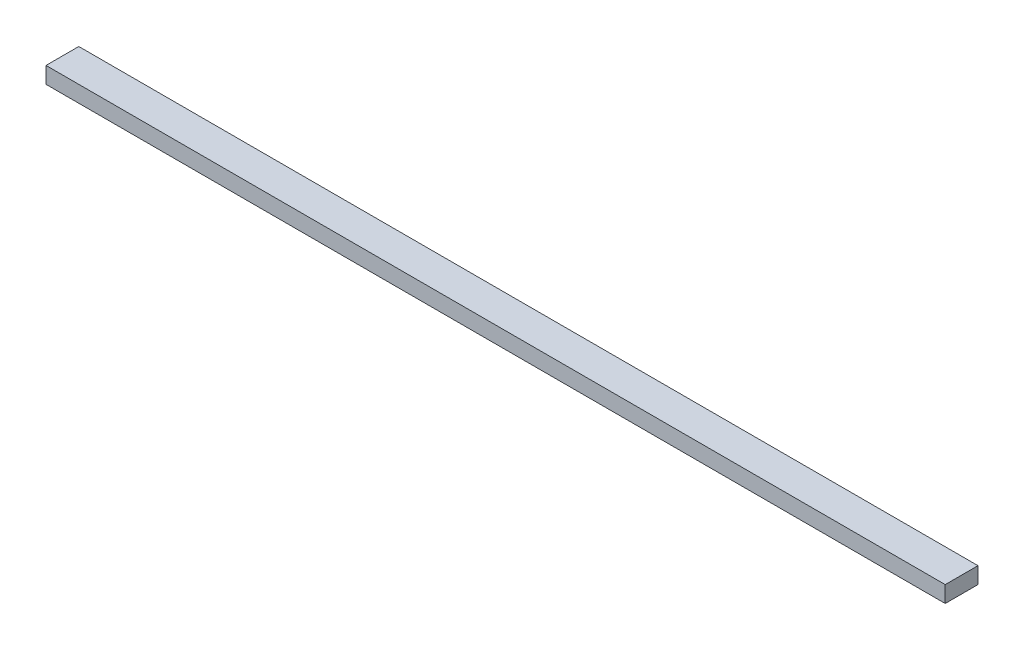
ISO-10303-21;
HEADER;
FILE_DESCRIPTION(('STEP AP214'),'2;1');
FILE_NAME('part.step','',(''),(''),'','','');
FILE_SCHEMA(('AUTOMOTIVE_DESIGN { 1 0 10303 214 1 1 1 1 }'));
ENDSEC;
DATA;
#1=APPLICATION_CONTEXT('core data for automotive mechanical design processes');
#2=APPLICATION_PROTOCOL_DEFINITION('international standard','automotive_design',2000,#1);
#3=PRODUCT_CONTEXT('',#1,'mechanical');
#4=PRODUCT('Part','Part','',(#3));
#5=PRODUCT_RELATED_PRODUCT_CATEGORY('part','',(#4));
#6=PRODUCT_DEFINITION_FORMATION('','',#4);
#7=PRODUCT_DEFINITION_CONTEXT('part definition',#1,'design');
#8=PRODUCT_DEFINITION('design','',#6,#7);
#9=PRODUCT_DEFINITION_SHAPE('','',#8);
#10=(LENGTH_UNIT() NAMED_UNIT(*) SI_UNIT(.MILLI.,.METRE.));
#11=(NAMED_UNIT(*) PLANE_ANGLE_UNIT() SI_UNIT($,.RADIAN.));
#12=(NAMED_UNIT(*) SI_UNIT($,.STERADIAN.) SOLID_ANGLE_UNIT());
#13=UNCERTAINTY_MEASURE_WITH_UNIT(LENGTH_MEASURE(1.E-05),#10,'distance_accuracy_value','');
#14=(GEOMETRIC_REPRESENTATION_CONTEXT(3) GLOBAL_UNCERTAINTY_ASSIGNED_CONTEXT((#13)) GLOBAL_UNIT_ASSIGNED_CONTEXT((#10,
#11,#12)) REPRESENTATION_CONTEXT('',''));
#15=CARTESIAN_POINT('',(0.,0.,0.));
#16=DIRECTION('',(0.,0.,1.));
#17=DIRECTION('',(1.,0.,0.));
#18=AXIS2_PLACEMENT_3D('',#15,#16,#17);
#19=CARTESIAN_POINT('',(-274.265,10.,-9.99999999999998));
#20=DIRECTION('',(1.,0.,0.));
#21=DIRECTION('',(0.,0.,-1.));
#22=AXIS2_PLACEMENT_3D('',#19,#20,#21);
#23=PLANE('',#22);
#24=DIRECTION('',(0.,0.,1.));
#25=VECTOR('',#24,1.);
#26=CARTESIAN_POINT('',(-274.265,0.,-9.99999999999998));
#27=LINE('',#26,#25);
#28=CARTESIAN_POINT('',(-274.265,0.,-9.99999999999998));
#29=VERTEX_POINT('',#28);
#30=CARTESIAN_POINT('',(-274.265,0.,10.));
#31=VERTEX_POINT('',#30);
#32=EDGE_CURVE('E95',#29,#31,#27,.T.);
#33=ORIENTED_EDGE('',*,*,#32,.T.);
#34=DIRECTION('',(0.,-1.,0.));
#35=VECTOR('',#34,1.);
#36=CARTESIAN_POINT('',(-274.265,10.,10.));
#37=LINE('',#36,#35);
#38=CARTESIAN_POINT('',(-274.265,10.,10.));
#39=VERTEX_POINT('',#38);
#40=EDGE_CURVE('E11',#39,#31,#37,.T.);
#41=ORIENTED_EDGE('',*,*,#40,.F.);
#42=DIRECTION('',(0.,0.,1.));
#43=VECTOR('',#42,1.);
#44=CARTESIAN_POINT('',(-274.265,10.,-9.99999999999998));
#45=LINE('',#44,#43);
#46=CARTESIAN_POINT('',(-274.265,10.,-9.99999999999998));
#47=VERTEX_POINT('',#46);
#48=EDGE_CURVE('E83',#47,#39,#45,.T.);
#49=ORIENTED_EDGE('',*,*,#48,.F.);
#50=DIRECTION('',(0.,-1.,0.));
#51=VECTOR('',#50,1.);
#52=CARTESIAN_POINT('',(-274.265,10.,-9.99999999999998));
#53=LINE('',#52,#51);
#54=EDGE_CURVE('E91',#47,#29,#53,.T.);
#55=ORIENTED_EDGE('',*,*,#54,.T.);
#56=EDGE_LOOP('',(#33,#41,#49,#55));
#57=FACE_BOUND('',#56,.T.);
#58=ADVANCED_FACE('F32',(#57),#23,.F.);
#59=CARTESIAN_POINT('',(-274.265,10.,10.));
#60=DIRECTION('',(0.,0.,-1.));
#61=DIRECTION('',(-1.,0.,0.));
#62=AXIS2_PLACEMENT_3D('',#59,#60,#61);
#63=PLANE('',#62);
#64=DIRECTION('',(1.,0.,0.));
#65=VECTOR('',#64,1.);
#66=CARTESIAN_POINT('',(-274.265,0.,10.));
#67=LINE('',#66,#65);
#68=CARTESIAN_POINT('',(274.265,0.,10.));
#69=VERTEX_POINT('',#68);
#70=EDGE_CURVE('E87',#31,#69,#67,.T.);
#71=ORIENTED_EDGE('',*,*,#70,.T.);
#72=DIRECTION('',(0.,-1.,0.));
#73=VECTOR('',#72,1.);
#74=CARTESIAN_POINT('',(274.265,10.,10.));
#75=LINE('',#74,#73);
#76=CARTESIAN_POINT('',(274.265,10.,10.));
#77=VERTEX_POINT('',#76);
#78=EDGE_CURVE('E40',#77,#69,#75,.T.);
#79=ORIENTED_EDGE('',*,*,#78,.F.);
#80=DIRECTION('',(1.,0.,0.));
#81=VECTOR('',#80,1.);
#82=CARTESIAN_POINT('',(-274.265,10.,10.));
#83=LINE('',#82,#81);
#84=EDGE_CURVE('E78',#39,#77,#83,.T.);
#85=ORIENTED_EDGE('',*,*,#84,.F.);
#86=ORIENTED_EDGE('',*,*,#40,.T.);
#87=EDGE_LOOP('',(#71,#79,#85,#86));
#88=FACE_BOUND('',#87,.T.);
#89=ADVANCED_FACE('F86',(#88),#63,.F.);
#90=CARTESIAN_POINT('',(274.265,10.,-9.99999999999998));
#91=DIRECTION('',(-1.,0.,0.));
#92=DIRECTION('',(0.,0.,1.));
#93=AXIS2_PLACEMENT_3D('',#90,#91,#92);
#94=PLANE('',#93);
#95=DIRECTION('',(0.,0.,-1.));
#96=VECTOR('',#95,1.);
#97=CARTESIAN_POINT('',(274.265,0.,-9.99999999999998));
#98=LINE('',#97,#96);
#99=CARTESIAN_POINT('',(274.265,0.,-9.99999999999998));
#100=VERTEX_POINT('',#99);
#101=EDGE_CURVE('E65',#69,#100,#98,.T.);
#102=ORIENTED_EDGE('',*,*,#101,.T.);
#103=DIRECTION('',(0.,-1.,0.));
#104=VECTOR('',#103,1.);
#105=CARTESIAN_POINT('',(274.265,10.,-9.99999999999998));
#106=LINE('',#105,#104);
#107=CARTESIAN_POINT('',(274.265,10.,-9.99999999999998));
#108=VERTEX_POINT('',#107);
#109=EDGE_CURVE('E88',#108,#100,#106,.T.);
#110=ORIENTED_EDGE('',*,*,#109,.F.);
#111=DIRECTION('',(0.,0.,-1.));
#112=VECTOR('',#111,1.);
#113=CARTESIAN_POINT('',(274.265,10.,-9.99999999999998));
#114=LINE('',#113,#112);
#115=EDGE_CURVE('E81',#77,#108,#114,.T.);
#116=ORIENTED_EDGE('',*,*,#115,.F.);
#117=ORIENTED_EDGE('',*,*,#78,.T.);
#118=EDGE_LOOP('',(#102,#110,#116,#117));
#119=FACE_BOUND('',#118,.T.);
#120=ADVANCED_FACE('F89',(#119),#94,.F.);
#121=CARTESIAN_POINT('',(-274.265,10.,-9.99999999999998));
#122=DIRECTION('',(0.,0.,1.));
#123=DIRECTION('',(1.,0.,0.));
#124=AXIS2_PLACEMENT_3D('',#121,#122,#123);
#125=PLANE('',#124);
#126=DIRECTION('',(-1.,0.,0.));
#127=VECTOR('',#126,1.);
#128=CARTESIAN_POINT('',(-274.265,0.,-9.99999999999998));
#129=LINE('',#128,#127);
#130=EDGE_CURVE('E71',#100,#29,#129,.T.);
#131=ORIENTED_EDGE('',*,*,#130,.T.);
#132=ORIENTED_EDGE('',*,*,#54,.F.);
#133=DIRECTION('',(-1.,0.,0.));
#134=VECTOR('',#133,1.);
#135=CARTESIAN_POINT('',(-274.265,10.,-9.99999999999998));
#136=LINE('',#135,#134);
#137=EDGE_CURVE('E48',#108,#47,#136,.T.);
#138=ORIENTED_EDGE('',*,*,#137,.F.);
#139=ORIENTED_EDGE('',*,*,#109,.T.);
#140=EDGE_LOOP('',(#131,#132,#138,#139));
#141=FACE_BOUND('',#140,.T.);
#142=ADVANCED_FACE('F102',(#141),#125,.F.);
#143=CARTESIAN_POINT('',(0.,10.,0.));
#144=DIRECTION('',(0.,1.,0.));
#145=DIRECTION('',(0.,0.,1.));
#146=AXIS2_PLACEMENT_3D('',#143,#144,#145);
#147=PLANE('',#146);
#148=ORIENTED_EDGE('',*,*,#48,.T.);
#149=ORIENTED_EDGE('',*,*,#84,.T.);
#150=ORIENTED_EDGE('',*,*,#115,.T.);
#151=ORIENTED_EDGE('',*,*,#137,.T.);
#152=EDGE_LOOP('',(#148,#149,#150,#151));
#153=FACE_BOUND('',#152,.T.);
#154=ADVANCED_FACE('F79',(#153),#147,.T.);
#155=CARTESIAN_POINT('',(0.,0.,0.));
#156=DIRECTION('',(0.,1.,0.));
#157=DIRECTION('',(0.,0.,1.));
#158=AXIS2_PLACEMENT_3D('',#155,#156,#157);
#159=PLANE('',#158);
#160=ORIENTED_EDGE('',*,*,#32,.F.);
#161=ORIENTED_EDGE('',*,*,#130,.F.);
#162=ORIENTED_EDGE('',*,*,#101,.F.);
#163=ORIENTED_EDGE('',*,*,#70,.F.);
#164=EDGE_LOOP('',(#160,#161,#162,#163));
#165=FACE_BOUND('',#164,.T.);
#166=ADVANCED_FACE('F105',(#165),#159,.F.);
#167=CLOSED_SHELL('',(#58,#89,#120,#142,#154,#166));
#168=MANIFOLD_SOLID_BREP('B2',#167);
#169=ADVANCED_BREP_SHAPE_REPRESENTATION('',(#18,#168),#14);
#170=SHAPE_DEFINITION_REPRESENTATION(#9,#169);
ENDSEC;
END-ISO-10303-21;
